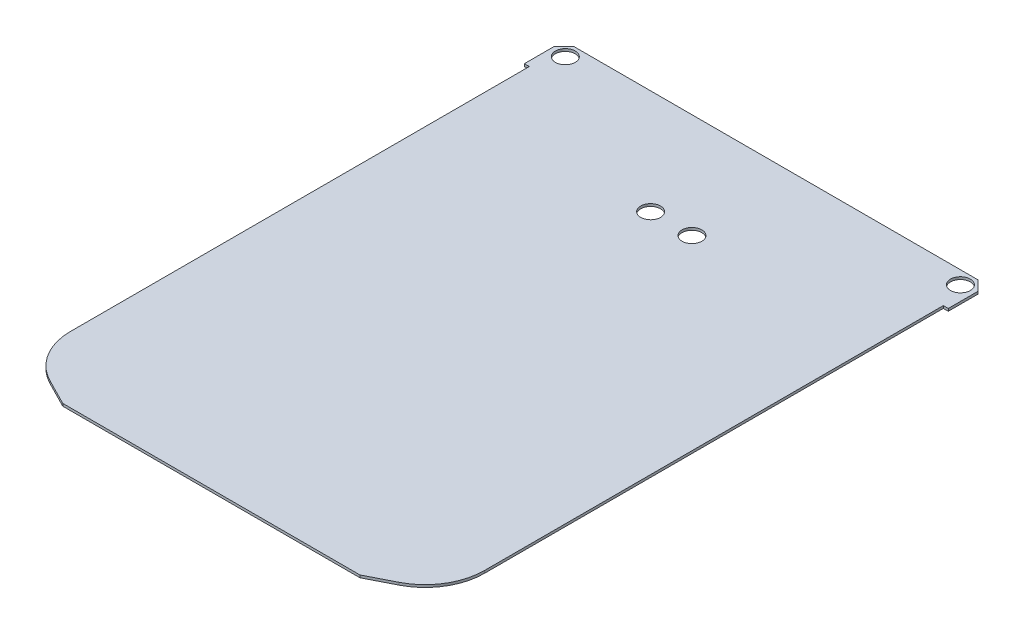
ISO-10303-21;
HEADER;
FILE_DESCRIPTION(('STEP AP214'),'2;1');
FILE_NAME('part.step','',(''),(''),'','','');
FILE_SCHEMA(('AUTOMOTIVE_DESIGN { 1 0 10303 214 1 1 1 1 }'));
ENDSEC;
DATA;
#1=APPLICATION_CONTEXT('core data for automotive mechanical design processes');
#2=APPLICATION_PROTOCOL_DEFINITION('international standard','automotive_design',2000,#1);
#3=PRODUCT_CONTEXT('',#1,'mechanical');
#4=PRODUCT('Part','Part','',(#3));
#5=PRODUCT_RELATED_PRODUCT_CATEGORY('part','',(#4));
#6=PRODUCT_DEFINITION_FORMATION('','',#4);
#7=PRODUCT_DEFINITION_CONTEXT('part definition',#1,'design');
#8=PRODUCT_DEFINITION('design','',#6,#7);
#9=PRODUCT_DEFINITION_SHAPE('','',#8);
#10=(LENGTH_UNIT() NAMED_UNIT(*) SI_UNIT(.MILLI.,.METRE.));
#11=(NAMED_UNIT(*) PLANE_ANGLE_UNIT() SI_UNIT($,.RADIAN.));
#12=(NAMED_UNIT(*) SI_UNIT($,.STERADIAN.) SOLID_ANGLE_UNIT());
#13=UNCERTAINTY_MEASURE_WITH_UNIT(LENGTH_MEASURE(1.E-05),#10,'distance_accuracy_value','');
#14=(GEOMETRIC_REPRESENTATION_CONTEXT(3) GLOBAL_UNCERTAINTY_ASSIGNED_CONTEXT((#13)) GLOBAL_UNIT_ASSIGNED_CONTEXT((#10,
#11,#12)) REPRESENTATION_CONTEXT('',''));
#15=CARTESIAN_POINT('',(0.,0.,0.));
#16=DIRECTION('',(0.,0.,1.));
#17=DIRECTION('',(1.,0.,0.));
#18=AXIS2_PLACEMENT_3D('',#15,#16,#17);
#19=CARTESIAN_POINT('',(0.,0.25,0.));
#20=DIRECTION('',(0.,1.,0.));
#21=DIRECTION('',(0.,0.,1.));
#22=AXIS2_PLACEMENT_3D('',#19,#20,#21);
#23=PLANE('',#22);
#24=CARTESIAN_POINT('',(-2.08453018887491,0.25,-19.9344650756313));
#25=DIRECTION('',(0.,1.,0.));
#26=DIRECTION('',(0.,0.,1.));
#27=AXIS2_PLACEMENT_3D('',#24,#25,#26);
#28=CIRCLE('',#27,1.);
#29=CARTESIAN_POINT('',(-2.08453018887491,0.25,-18.9344650756313));
#30=VERTEX_POINT('',#29);
#31=EDGE_CURVE('E170',#30,#30,#28,.T.);
#32=ORIENTED_EDGE('',*,*,#31,.F.);
#33=EDGE_LOOP('',(#32));
#34=FACE_BOUND('',#33,.T.);
#35=CARTESIAN_POINT('',(2.08453018887492,0.25,-19.9344650756313));
#36=DIRECTION('',(0.,1.,0.));
#37=DIRECTION('',(0.,0.,1.));
#38=AXIS2_PLACEMENT_3D('',#35,#36,#37);
#39=CIRCLE('',#38,1.);
#40=CARTESIAN_POINT('',(2.08453018887492,0.25,-18.9344650756312));
#41=VERTEX_POINT('',#40);
#42=EDGE_CURVE('E275',#41,#41,#39,.T.);
#43=ORIENTED_EDGE('',*,*,#42,.F.);
#44=EDGE_LOOP('',(#43));
#45=FACE_BOUND('',#44,.T.);
#46=CARTESIAN_POINT('',(19.9443650813896,0.25,-29.1813924256585));
#47=DIRECTION('',(0.,1.,0.));
#48=DIRECTION('',(0.,0.,-1.));
#49=AXIS2_PLACEMENT_3D('',#46,#47,#48);
#50=CIRCLE('',#49,1.00000000000001);
#51=CARTESIAN_POINT('',(19.9443650813896,0.25,-30.1813924256585));
#52=VERTEX_POINT('',#51);
#53=EDGE_CURVE('E262',#52,#52,#50,.T.);
#54=ORIENTED_EDGE('',*,*,#53,.F.);
#55=EDGE_LOOP('',(#54));
#56=FACE_BOUND('',#55,.T.);
#57=DIRECTION('',(0.891385130206805,0.,-0.453246676376339));
#58=VECTOR('',#57,1.);
#59=CARTESIAN_POINT('',(15.,0.25,26.5));
#60=LINE('',#59,#58);
#61=CARTESIAN_POINT('',(15.,0.25,26.5));
#62=VERTEX_POINT('',#61);
#63=CARTESIAN_POINT('',(17.619480058258,0.25,25.1680609873264));
#64=VERTEX_POINT('',#63);
#65=EDGE_CURVE('E245',#62,#64,#60,.T.);
#66=ORIENTED_EDGE('',*,*,#65,.T.);
#67=CARTESIAN_POINT('',(14.9,0.25,19.8197502060856));
#68=DIRECTION('',(0.,1.,0.));
#69=DIRECTION('',(0.,0.,1.));
#70=AXIS2_PLACEMENT_3D('',#67,#68,#69);
#71=CIRCLE('',#70,6.);
#72=CARTESIAN_POINT('',(20.9,0.25,19.8197502060856));
#73=VERTEX_POINT('',#72);
#74=EDGE_CURVE('E180',#64,#73,#71,.T.);
#75=ORIENTED_EDGE('',*,*,#74,.T.);
#76=DIRECTION('',(0.,0.,-1.));
#77=VECTOR('',#76,1.);
#78=CARTESIAN_POINT('',(20.9,0.25,23.5));
#79=LINE('',#78,#77);
#80=CARTESIAN_POINT('',(20.9,0.25,-26.5));
#81=VERTEX_POINT('',#80);
#82=EDGE_CURVE('E247',#73,#81,#79,.T.);
#83=ORIENTED_EDGE('',*,*,#82,.T.);
#84=DIRECTION('',(1.,0.,0.));
#85=VECTOR('',#84,1.);
#86=CARTESIAN_POINT('',(21.4,0.25,-26.5));
#87=LINE('',#86,#85);
#88=CARTESIAN_POINT('',(21.4,0.25,-26.5));
#89=VERTEX_POINT('',#88);
#90=EDGE_CURVE('E253',#81,#89,#87,.T.);
#91=ORIENTED_EDGE('',*,*,#90,.T.);
#92=DIRECTION('',(0.,0.,-1.));
#93=VECTOR('',#92,1.);
#94=CARTESIAN_POINT('',(21.4,0.25,-29.5));
#95=LINE('',#94,#93);
#96=CARTESIAN_POINT('',(21.4,0.25,-29.5));
#97=VERTEX_POINT('',#96);
#98=EDGE_CURVE('E255',#89,#97,#95,.T.);
#99=ORIENTED_EDGE('',*,*,#98,.T.);
#100=DIRECTION('',(-0.707106781186546,0.,-0.707106781186549));
#101=VECTOR('',#100,1.);
#102=CARTESIAN_POINT('',(21.4,0.25,-29.5));
#103=LINE('',#102,#101);
#104=CARTESIAN_POINT('',(20.4,0.25,-30.5));
#105=VERTEX_POINT('',#104);
#106=EDGE_CURVE('E257',#97,#105,#103,.T.);
#107=ORIENTED_EDGE('',*,*,#106,.T.);
#108=DIRECTION('',(-1.,0.,0.));
#109=VECTOR('',#108,1.);
#110=CARTESIAN_POINT('',(-20.4,0.25,-30.5));
#111=LINE('',#110,#109);
#112=CARTESIAN_POINT('',(-20.4,0.25,-30.5));
#113=VERTEX_POINT('',#112);
#114=EDGE_CURVE('E259',#105,#113,#111,.T.);
#115=ORIENTED_EDGE('',*,*,#114,.T.);
#116=DIRECTION('',(-0.707106781186544,0.,0.707106781186551));
#117=VECTOR('',#116,1.);
#118=CARTESIAN_POINT('',(-21.4,0.25,-29.5));
#119=LINE('',#118,#117);
#120=CARTESIAN_POINT('',(-21.4,0.25,-29.5));
#121=VERTEX_POINT('',#120);
#122=EDGE_CURVE('E148',#113,#121,#119,.T.);
#123=ORIENTED_EDGE('',*,*,#122,.T.);
#124=DIRECTION('',(0.,0.,1.));
#125=VECTOR('',#124,1.);
#126=CARTESIAN_POINT('',(-21.4,0.25,-29.5));
#127=LINE('',#126,#125);
#128=CARTESIAN_POINT('',(-21.4,0.25,-26.5));
#129=VERTEX_POINT('',#128);
#130=EDGE_CURVE('E142',#121,#129,#127,.T.);
#131=ORIENTED_EDGE('',*,*,#130,.T.);
#132=DIRECTION('',(1.,0.,0.));
#133=VECTOR('',#132,1.);
#134=CARTESIAN_POINT('',(-21.4,0.25,-26.5));
#135=LINE('',#134,#133);
#136=CARTESIAN_POINT('',(-20.9,0.25,-26.5));
#137=VERTEX_POINT('',#136);
#138=EDGE_CURVE('E133',#129,#137,#135,.T.);
#139=ORIENTED_EDGE('',*,*,#138,.T.);
#140=DIRECTION('',(0.,0.,1.));
#141=VECTOR('',#140,1.);
#142=CARTESIAN_POINT('',(-20.9,0.25,-26.5));
#143=LINE('',#142,#141);
#144=CARTESIAN_POINT('',(-20.9,0.25,19.8197502060856));
#145=VERTEX_POINT('',#144);
#146=EDGE_CURVE('E141',#137,#145,#143,.T.);
#147=ORIENTED_EDGE('',*,*,#146,.T.);
#148=CARTESIAN_POINT('',(-14.9,0.25,19.8197502060856));
#149=DIRECTION('',(0.,1.,0.));
#150=DIRECTION('',(0.,0.,1.));
#151=AXIS2_PLACEMENT_3D('',#148,#149,#150);
#152=CIRCLE('',#151,6.);
#153=CARTESIAN_POINT('',(-17.619480058258,0.25,25.1680609873264));
#154=VERTEX_POINT('',#153);
#155=EDGE_CURVE('E47',#145,#154,#152,.T.);
#156=ORIENTED_EDGE('',*,*,#155,.T.);
#157=DIRECTION('',(0.891385130206805,0.,0.453246676376339));
#158=VECTOR('',#157,1.);
#159=CARTESIAN_POINT('',(-20.9,0.25,23.5));
#160=LINE('',#159,#158);
#161=CARTESIAN_POINT('',(-15.,0.25,26.5));
#162=VERTEX_POINT('',#161);
#163=EDGE_CURVE('E189',#154,#162,#160,.T.);
#164=ORIENTED_EDGE('',*,*,#163,.T.);
#165=DIRECTION('',(1.,0.,0.));
#166=VECTOR('',#165,1.);
#167=CARTESIAN_POINT('',(-15.,0.25,26.5));
#168=LINE('',#167,#166);
#169=EDGE_CURVE('E243',#162,#62,#168,.T.);
#170=ORIENTED_EDGE('',*,*,#169,.T.);
#171=EDGE_LOOP('',(#66,#75,#83,#91,#99,#107,#115,#123,#131,#139,#147,#156,#164,#170));
#172=FACE_BOUND('',#171,.T.);
#173=CARTESIAN_POINT('',(-19.9443650813896,0.25,-29.1813924256585));
#174=DIRECTION('',(0.,1.,0.));
#175=DIRECTION('',(0.,0.,1.));
#176=AXIS2_PLACEMENT_3D('',#173,#174,#175);
#177=CIRCLE('',#176,0.999999999999998);
#178=CARTESIAN_POINT('',(-19.9443650813896,0.25,-28.1813924256585));
#179=VERTEX_POINT('',#178);
#180=EDGE_CURVE('E268',#179,#179,#177,.T.);
#181=ORIENTED_EDGE('',*,*,#180,.F.);
#182=EDGE_LOOP('',(#181));
#183=FACE_BOUND('',#182,.T.);
#184=ADVANCED_FACE('F32',(#34,#45,#56,#172,#183),#23,.T.);
#185=CARTESIAN_POINT('',(0.,0.,0.));
#186=DIRECTION('',(0.,1.,0.));
#187=DIRECTION('',(0.,0.,1.));
#188=AXIS2_PLACEMENT_3D('',#185,#186,#187);
#189=PLANE('',#188);
#190=CARTESIAN_POINT('',(-2.08453018887491,0.,-19.9344650756313));
#191=DIRECTION('',(0.,1.,0.));
#192=DIRECTION('',(0.,0.,1.));
#193=AXIS2_PLACEMENT_3D('',#190,#191,#192);
#194=CIRCLE('',#193,1.);
#195=CARTESIAN_POINT('',(-2.08453018887491,0.,-18.9344650756313));
#196=VERTEX_POINT('',#195);
#197=EDGE_CURVE('E169',#196,#196,#194,.T.);
#198=ORIENTED_EDGE('',*,*,#197,.T.);
#199=EDGE_LOOP('',(#198));
#200=FACE_BOUND('',#199,.T.);
#201=CARTESIAN_POINT('',(2.08453018887492,0.,-19.9344650756313));
#202=DIRECTION('',(0.,1.,0.));
#203=DIRECTION('',(0.,0.,1.));
#204=AXIS2_PLACEMENT_3D('',#201,#202,#203);
#205=CIRCLE('',#204,1.);
#206=CARTESIAN_POINT('',(2.08453018887492,0.,-18.9344650756312));
#207=VERTEX_POINT('',#206);
#208=EDGE_CURVE('E166',#207,#207,#205,.T.);
#209=ORIENTED_EDGE('',*,*,#208,.T.);
#210=EDGE_LOOP('',(#209));
#211=FACE_BOUND('',#210,.T.);
#212=DIRECTION('',(0.,0.,-1.));
#213=VECTOR('',#212,1.);
#214=CARTESIAN_POINT('',(20.9,0.,23.5));
#215=LINE('',#214,#213);
#216=CARTESIAN_POINT('',(20.9,0.,19.8197502060856));
#217=VERTEX_POINT('',#216);
#218=CARTESIAN_POINT('',(20.9,0.,-26.5));
#219=VERTEX_POINT('',#218);
#220=EDGE_CURVE('E209',#217,#219,#215,.T.);
#221=ORIENTED_EDGE('',*,*,#220,.F.);
#222=CARTESIAN_POINT('',(14.9,0.,19.8197502060856));
#223=DIRECTION('',(0.,1.,0.));
#224=DIRECTION('',(0.,0.,1.));
#225=AXIS2_PLACEMENT_3D('',#222,#223,#224);
#226=CIRCLE('',#225,6.);
#227=CARTESIAN_POINT('',(17.619480058258,0.,25.1680609873264));
#228=VERTEX_POINT('',#227);
#229=EDGE_CURVE('E175',#217,#228,#226,.F.);
#230=ORIENTED_EDGE('',*,*,#229,.T.);
#231=DIRECTION('',(0.891385130206805,0.,-0.453246676376339));
#232=VECTOR('',#231,1.);
#233=CARTESIAN_POINT('',(15.,0.,26.5));
#234=LINE('',#233,#232);
#235=CARTESIAN_POINT('',(15.,0.,26.5));
#236=VERTEX_POINT('',#235);
#237=EDGE_CURVE('E201',#236,#228,#234,.T.);
#238=ORIENTED_EDGE('',*,*,#237,.F.);
#239=DIRECTION('',(1.,0.,0.));
#240=VECTOR('',#239,1.);
#241=CARTESIAN_POINT('',(-15.,0.,26.5));
#242=LINE('',#241,#240);
#243=CARTESIAN_POINT('',(-15.,0.,26.5));
#244=VERTEX_POINT('',#243);
#245=EDGE_CURVE('E198',#244,#236,#242,.T.);
#246=ORIENTED_EDGE('',*,*,#245,.F.);
#247=DIRECTION('',(0.891385130206805,0.,0.453246676376339));
#248=VECTOR('',#247,1.);
#249=CARTESIAN_POINT('',(-20.9,0.,23.5));
#250=LINE('',#249,#248);
#251=CARTESIAN_POINT('',(-17.619480058258,0.,25.1680609873264));
#252=VERTEX_POINT('',#251);
#253=EDGE_CURVE('E187',#252,#244,#250,.T.);
#254=ORIENTED_EDGE('',*,*,#253,.F.);
#255=CARTESIAN_POINT('',(-14.9,0.,19.8197502060856));
#256=DIRECTION('',(0.,1.,0.));
#257=DIRECTION('',(0.,0.,1.));
#258=AXIS2_PLACEMENT_3D('',#255,#256,#257);
#259=CIRCLE('',#258,6.);
#260=CARTESIAN_POINT('',(-20.9,0.,19.8197502060856));
#261=VERTEX_POINT('',#260);
#262=EDGE_CURVE('E160',#252,#261,#259,.F.);
#263=ORIENTED_EDGE('',*,*,#262,.T.);
#264=DIRECTION('',(0.,0.,1.));
#265=VECTOR('',#264,1.);
#266=CARTESIAN_POINT('',(-20.9,0.,-26.5));
#267=LINE('',#266,#265);
#268=CARTESIAN_POINT('',(-20.9,0.,-26.5));
#269=VERTEX_POINT('',#268);
#270=EDGE_CURVE('E199',#269,#261,#267,.T.);
#271=ORIENTED_EDGE('',*,*,#270,.F.);
#272=DIRECTION('',(1.,0.,0.));
#273=VECTOR('',#272,1.);
#274=CARTESIAN_POINT('',(-21.4,0.,-26.5));
#275=LINE('',#274,#273);
#276=CARTESIAN_POINT('',(-21.4,0.,-26.5));
#277=VERTEX_POINT('',#276);
#278=EDGE_CURVE('E203',#277,#269,#275,.T.);
#279=ORIENTED_EDGE('',*,*,#278,.F.);
#280=DIRECTION('',(0.,0.,1.));
#281=VECTOR('',#280,1.);
#282=CARTESIAN_POINT('',(-21.4,0.,-29.5));
#283=LINE('',#282,#281);
#284=CARTESIAN_POINT('',(-21.4,0.,-29.5));
#285=VERTEX_POINT('',#284);
#286=EDGE_CURVE('E156',#285,#277,#283,.T.);
#287=ORIENTED_EDGE('',*,*,#286,.F.);
#288=DIRECTION('',(-0.707106781186544,0.,0.707106781186551));
#289=VECTOR('',#288,1.);
#290=CARTESIAN_POINT('',(-21.4,0.,-29.5));
#291=LINE('',#290,#289);
#292=CARTESIAN_POINT('',(-20.4,0.,-30.5));
#293=VERTEX_POINT('',#292);
#294=EDGE_CURVE('E152',#293,#285,#291,.T.);
#295=ORIENTED_EDGE('',*,*,#294,.F.);
#296=DIRECTION('',(-1.,0.,0.));
#297=VECTOR('',#296,1.);
#298=CARTESIAN_POINT('',(-20.4,0.,-30.5));
#299=LINE('',#298,#297);
#300=CARTESIAN_POINT('',(20.4,0.,-30.5));
#301=VERTEX_POINT('',#300);
#302=EDGE_CURVE('E217',#301,#293,#299,.T.);
#303=ORIENTED_EDGE('',*,*,#302,.F.);
#304=DIRECTION('',(-0.707106781186546,0.,-0.707106781186549));
#305=VECTOR('',#304,1.);
#306=CARTESIAN_POINT('',(21.4,0.,-29.5));
#307=LINE('',#306,#305);
#308=CARTESIAN_POINT('',(21.4,0.,-29.5));
#309=VERTEX_POINT('',#308);
#310=EDGE_CURVE('E215',#309,#301,#307,.T.);
#311=ORIENTED_EDGE('',*,*,#310,.F.);
#312=DIRECTION('',(0.,0.,-1.));
#313=VECTOR('',#312,1.);
#314=CARTESIAN_POINT('',(21.4,0.,-29.5));
#315=LINE('',#314,#313);
#316=CARTESIAN_POINT('',(21.4,0.,-26.5));
#317=VERTEX_POINT('',#316);
#318=EDGE_CURVE('E213',#317,#309,#315,.T.);
#319=ORIENTED_EDGE('',*,*,#318,.F.);
#320=DIRECTION('',(1.,0.,0.));
#321=VECTOR('',#320,1.);
#322=CARTESIAN_POINT('',(21.4,0.,-26.5));
#323=LINE('',#322,#321);
#324=EDGE_CURVE('E211',#219,#317,#323,.T.);
#325=ORIENTED_EDGE('',*,*,#324,.F.);
#326=EDGE_LOOP('',(#221,#230,#238,#246,#254,#263,#271,#279,#287,#295,#303,#311,#319,#325));
#327=FACE_BOUND('',#326,.T.);
#328=CARTESIAN_POINT('',(19.9443650813896,0.,-29.1813924256585));
#329=DIRECTION('',(0.,1.,0.));
#330=DIRECTION('',(0.,0.,-1.));
#331=AXIS2_PLACEMENT_3D('',#328,#329,#330);
#332=CIRCLE('',#331,1.00000000000001);
#333=CARTESIAN_POINT('',(19.9443650813896,0.,-30.1813924256585));
#334=VERTEX_POINT('',#333);
#335=EDGE_CURVE('E265',#334,#334,#332,.T.);
#336=ORIENTED_EDGE('',*,*,#335,.T.);
#337=EDGE_LOOP('',(#336));
#338=FACE_BOUND('',#337,.T.);
#339=CARTESIAN_POINT('',(-19.9443650813896,0.,-29.1813924256585));
#340=DIRECTION('',(0.,1.,0.));
#341=DIRECTION('',(0.,0.,1.));
#342=AXIS2_PLACEMENT_3D('',#339,#340,#341);
#343=CIRCLE('',#342,0.999999999999998);
#344=CARTESIAN_POINT('',(-19.9443650813896,0.,-28.1813924256585));
#345=VERTEX_POINT('',#344);
#346=EDGE_CURVE('E172',#345,#345,#343,.T.);
#347=ORIENTED_EDGE('',*,*,#346,.T.);
#348=EDGE_LOOP('',(#347));
#349=FACE_BOUND('',#348,.T.);
#350=ADVANCED_FACE('F194',(#200,#211,#327,#338,#349),#189,.F.);
#351=CARTESIAN_POINT('',(-21.4,0.25,-29.5));
#352=DIRECTION('',(1.,0.,0.));
#353=DIRECTION('',(0.,0.,-1.));
#354=AXIS2_PLACEMENT_3D('',#351,#352,#353);
#355=PLANE('',#354);
#356=ORIENTED_EDGE('',*,*,#286,.T.);
#357=DIRECTION('',(0.,-1.,0.));
#358=VECTOR('',#357,1.);
#359=CARTESIAN_POINT('',(-21.4,0.25,-26.5));
#360=LINE('',#359,#358);
#361=EDGE_CURVE('E137',#129,#277,#360,.T.);
#362=ORIENTED_EDGE('',*,*,#361,.F.);
#363=ORIENTED_EDGE('',*,*,#130,.F.);
#364=DIRECTION('',(0.,-1.,0.));
#365=VECTOR('',#364,1.);
#366=CARTESIAN_POINT('',(-21.4,0.25,-29.5));
#367=LINE('',#366,#365);
#368=EDGE_CURVE('E220',#121,#285,#367,.T.);
#369=ORIENTED_EDGE('',*,*,#368,.T.);
#370=EDGE_LOOP('',(#356,#362,#363,#369));
#371=FACE_BOUND('',#370,.T.);
#372=ADVANCED_FACE('F154',(#371),#355,.F.);
#373=CARTESIAN_POINT('',(-21.4,0.25,-26.5));
#374=DIRECTION('',(0.,0.,-1.));
#375=DIRECTION('',(-1.,0.,0.));
#376=AXIS2_PLACEMENT_3D('',#373,#374,#375);
#377=PLANE('',#376);
#378=ORIENTED_EDGE('',*,*,#278,.T.);
#379=DIRECTION('',(0.,-1.,0.));
#380=VECTOR('',#379,1.);
#381=CARTESIAN_POINT('',(-20.9,0.25,-26.5));
#382=LINE('',#381,#380);
#383=EDGE_CURVE('E140',#137,#269,#382,.T.);
#384=ORIENTED_EDGE('',*,*,#383,.F.);
#385=ORIENTED_EDGE('',*,*,#138,.F.);
#386=ORIENTED_EDGE('',*,*,#361,.T.);
#387=EDGE_LOOP('',(#378,#384,#385,#386));
#388=FACE_BOUND('',#387,.T.);
#389=ADVANCED_FACE('F135',(#388),#377,.F.);
#390=CARTESIAN_POINT('',(-20.9,0.25,-26.5));
#391=DIRECTION('',(1.,0.,0.));
#392=DIRECTION('',(0.,0.,-1.));
#393=AXIS2_PLACEMENT_3D('',#390,#391,#392);
#394=PLANE('',#393);
#395=ORIENTED_EDGE('',*,*,#270,.T.);
#396=DIRECTION('',(0.,-1.,0.));
#397=VECTOR('',#396,1.);
#398=CARTESIAN_POINT('',(-20.9,0.25,19.8197502060856));
#399=LINE('',#398,#397);
#400=EDGE_CURVE('E11',#261,#145,#399,.F.);
#401=ORIENTED_EDGE('',*,*,#400,.T.);
#402=ORIENTED_EDGE('',*,*,#146,.F.);
#403=ORIENTED_EDGE('',*,*,#383,.T.);
#404=EDGE_LOOP('',(#395,#401,#402,#403));
#405=FACE_BOUND('',#404,.T.);
#406=ADVANCED_FACE('F263',(#405),#394,.F.);
#407=CARTESIAN_POINT('',(-20.9,0.25,23.5));
#408=DIRECTION('',(0.453246676376339,0.,-0.891385130206805));
#409=DIRECTION('',(-0.891385130206805,0.,-0.453246676376339));
#410=AXIS2_PLACEMENT_3D('',#407,#408,#409);
#411=PLANE('',#410);
#412=ORIENTED_EDGE('',*,*,#163,.F.);
#413=DIRECTION('',(0.,-1.,0.));
#414=VECTOR('',#413,1.);
#415=CARTESIAN_POINT('',(-17.619480058258,0.25,25.1680609873264));
#416=LINE('',#415,#414);
#417=EDGE_CURVE('E40',#154,#252,#416,.T.);
#418=ORIENTED_EDGE('',*,*,#417,.T.);
#419=ORIENTED_EDGE('',*,*,#253,.T.);
#420=DIRECTION('',(0.,-1.,0.));
#421=VECTOR('',#420,1.);
#422=CARTESIAN_POINT('',(-15.,0.25,26.5));
#423=LINE('',#422,#421);
#424=EDGE_CURVE('E162',#162,#244,#423,.T.);
#425=ORIENTED_EDGE('',*,*,#424,.F.);
#426=EDGE_LOOP('',(#412,#418,#419,#425));
#427=FACE_BOUND('',#426,.T.);
#428=ADVANCED_FACE('F185',(#427),#411,.F.);
#429=CARTESIAN_POINT('',(-15.,0.25,26.5));
#430=DIRECTION('',(0.,0.,-1.));
#431=DIRECTION('',(-1.,0.,0.));
#432=AXIS2_PLACEMENT_3D('',#429,#430,#431);
#433=PLANE('',#432);
#434=ORIENTED_EDGE('',*,*,#245,.T.);
#435=DIRECTION('',(0.,-1.,0.));
#436=VECTOR('',#435,1.);
#437=CARTESIAN_POINT('',(15.,0.25,26.5));
#438=LINE('',#437,#436);
#439=EDGE_CURVE('E237',#62,#236,#438,.T.);
#440=ORIENTED_EDGE('',*,*,#439,.F.);
#441=ORIENTED_EDGE('',*,*,#169,.F.);
#442=ORIENTED_EDGE('',*,*,#424,.T.);
#443=EDGE_LOOP('',(#434,#440,#441,#442));
#444=FACE_BOUND('',#443,.T.);
#445=ADVANCED_FACE('F241',(#444),#433,.F.);
#446=CARTESIAN_POINT('',(15.,0.25,26.5));
#447=DIRECTION('',(-0.453246676376339,0.,-0.891385130206805));
#448=DIRECTION('',(-0.891385130206805,0.,0.453246676376339));
#449=AXIS2_PLACEMENT_3D('',#446,#447,#448);
#450=PLANE('',#449);
#451=ORIENTED_EDGE('',*,*,#237,.T.);
#452=DIRECTION('',(0.,-1.,0.));
#453=VECTOR('',#452,1.);
#454=CARTESIAN_POINT('',(17.619480058258,0.25,25.1680609873264));
#455=LINE('',#454,#453);
#456=EDGE_CURVE('E177',#228,#64,#455,.F.);
#457=ORIENTED_EDGE('',*,*,#456,.T.);
#458=ORIENTED_EDGE('',*,*,#65,.F.);
#459=ORIENTED_EDGE('',*,*,#439,.T.);
#460=EDGE_LOOP('',(#451,#457,#458,#459));
#461=FACE_BOUND('',#460,.T.);
#462=ADVANCED_FACE('F337',(#461),#450,.F.);
#463=CARTESIAN_POINT('',(20.9,0.25,23.5));
#464=DIRECTION('',(-1.,0.,0.));
#465=DIRECTION('',(0.,0.,1.));
#466=AXIS2_PLACEMENT_3D('',#463,#464,#465);
#467=PLANE('',#466);
#468=ORIENTED_EDGE('',*,*,#82,.F.);
#469=DIRECTION('',(0.,-1.,0.));
#470=VECTOR('',#469,1.);
#471=CARTESIAN_POINT('',(20.9,0.25,19.8197502060856));
#472=LINE('',#471,#470);
#473=EDGE_CURVE('E157',#73,#217,#472,.T.);
#474=ORIENTED_EDGE('',*,*,#473,.T.);
#475=ORIENTED_EDGE('',*,*,#220,.T.);
#476=DIRECTION('',(0.,-1.,0.));
#477=VECTOR('',#476,1.);
#478=CARTESIAN_POINT('',(20.9,0.25,-26.5));
#479=LINE('',#478,#477);
#480=EDGE_CURVE('E234',#81,#219,#479,.T.);
#481=ORIENTED_EDGE('',*,*,#480,.F.);
#482=EDGE_LOOP('',(#468,#474,#475,#481));
#483=FACE_BOUND('',#482,.T.);
#484=ADVANCED_FACE('F333',(#483),#467,.F.);
#485=CARTESIAN_POINT('',(21.4,0.25,-26.5));
#486=DIRECTION('',(0.,0.,-1.));
#487=DIRECTION('',(-1.,0.,0.));
#488=AXIS2_PLACEMENT_3D('',#485,#486,#487);
#489=PLANE('',#488);
#490=ORIENTED_EDGE('',*,*,#324,.T.);
#491=DIRECTION('',(0.,-1.,0.));
#492=VECTOR('',#491,1.);
#493=CARTESIAN_POINT('',(21.4,0.25,-26.5));
#494=LINE('',#493,#492);
#495=EDGE_CURVE('E231',#89,#317,#494,.T.);
#496=ORIENTED_EDGE('',*,*,#495,.F.);
#497=ORIENTED_EDGE('',*,*,#90,.F.);
#498=ORIENTED_EDGE('',*,*,#480,.T.);
#499=EDGE_LOOP('',(#490,#496,#497,#498));
#500=FACE_BOUND('',#499,.T.);
#501=ADVANCED_FACE('F329',(#500),#489,.F.);
#502=CARTESIAN_POINT('',(21.4,0.25,-29.5));
#503=DIRECTION('',(-1.,0.,0.));
#504=DIRECTION('',(0.,0.,1.));
#505=AXIS2_PLACEMENT_3D('',#502,#503,#504);
#506=PLANE('',#505);
#507=ORIENTED_EDGE('',*,*,#318,.T.);
#508=DIRECTION('',(0.,-1.,0.));
#509=VECTOR('',#508,1.);
#510=CARTESIAN_POINT('',(21.4,0.25,-29.5));
#511=LINE('',#510,#509);
#512=EDGE_CURVE('E228',#97,#309,#511,.T.);
#513=ORIENTED_EDGE('',*,*,#512,.F.);
#514=ORIENTED_EDGE('',*,*,#98,.F.);
#515=ORIENTED_EDGE('',*,*,#495,.T.);
#516=EDGE_LOOP('',(#507,#513,#514,#515));
#517=FACE_BOUND('',#516,.T.);
#518=ADVANCED_FACE('F325',(#517),#506,.F.);
#519=CARTESIAN_POINT('',(21.4,0.25,-29.5));
#520=DIRECTION('',(-0.707106781186549,0.,0.707106781186546));
#521=DIRECTION('',(0.707106781186546,0.,0.707106781186549));
#522=AXIS2_PLACEMENT_3D('',#519,#520,#521);
#523=PLANE('',#522);
#524=ORIENTED_EDGE('',*,*,#310,.T.);
#525=DIRECTION('',(0.,-1.,0.));
#526=VECTOR('',#525,1.);
#527=CARTESIAN_POINT('',(20.4,0.25,-30.5));
#528=LINE('',#527,#526);
#529=EDGE_CURVE('E225',#105,#301,#528,.T.);
#530=ORIENTED_EDGE('',*,*,#529,.F.);
#531=ORIENTED_EDGE('',*,*,#106,.F.);
#532=ORIENTED_EDGE('',*,*,#512,.T.);
#533=EDGE_LOOP('',(#524,#530,#531,#532));
#534=FACE_BOUND('',#533,.T.);
#535=ADVANCED_FACE('F321',(#534),#523,.F.);
#536=CARTESIAN_POINT('',(-20.4,0.25,-30.5));
#537=DIRECTION('',(0.,0.,1.));
#538=DIRECTION('',(1.,0.,0.));
#539=AXIS2_PLACEMENT_3D('',#536,#537,#538);
#540=PLANE('',#539);
#541=ORIENTED_EDGE('',*,*,#302,.T.);
#542=DIRECTION('',(0.,-1.,0.));
#543=VECTOR('',#542,1.);
#544=CARTESIAN_POINT('',(-20.4,0.25,-30.5));
#545=LINE('',#544,#543);
#546=EDGE_CURVE('E222',#113,#293,#545,.T.);
#547=ORIENTED_EDGE('',*,*,#546,.F.);
#548=ORIENTED_EDGE('',*,*,#114,.F.);
#549=ORIENTED_EDGE('',*,*,#529,.T.);
#550=EDGE_LOOP('',(#541,#547,#548,#549));
#551=FACE_BOUND('',#550,.T.);
#552=ADVANCED_FACE('F317',(#551),#540,.F.);
#553=CARTESIAN_POINT('',(-21.4,0.25,-29.5));
#554=DIRECTION('',(0.707106781186551,0.,0.707106781186544));
#555=DIRECTION('',(0.707106781186544,0.,-0.707106781186551));
#556=AXIS2_PLACEMENT_3D('',#553,#554,#555);
#557=PLANE('',#556);
#558=ORIENTED_EDGE('',*,*,#294,.T.);
#559=ORIENTED_EDGE('',*,*,#368,.F.);
#560=ORIENTED_EDGE('',*,*,#122,.F.);
#561=ORIENTED_EDGE('',*,*,#546,.T.);
#562=EDGE_LOOP('',(#558,#559,#560,#561));
#563=FACE_BOUND('',#562,.T.);
#564=ADVANCED_FACE('F295',(#563),#557,.F.);
#565=CARTESIAN_POINT('',(19.9443650813896,0.25,-29.1813924256585));
#566=DIRECTION('',(0.,-1.,0.));
#567=DIRECTION('',(0.,0.,-1.));
#568=AXIS2_PLACEMENT_3D('',#565,#566,#567);
#569=CYLINDRICAL_SURFACE('',#568,1.00000000000001);
#570=ORIENTED_EDGE('',*,*,#53,.T.);
#571=EDGE_LOOP('',(#570));
#572=FACE_BOUND('',#571,.T.);
#573=ORIENTED_EDGE('',*,*,#335,.F.);
#574=EDGE_LOOP('',(#573));
#575=FACE_BOUND('',#574,.T.);
#576=ADVANCED_FACE('F291',(#572,#575),#569,.F.);
#577=CARTESIAN_POINT('',(-19.9443650813896,0.25,-29.1813924256585));
#578=DIRECTION('',(0.,-1.,0.));
#579=DIRECTION('',(0.,0.,-1.));
#580=AXIS2_PLACEMENT_3D('',#577,#578,#579);
#581=CYLINDRICAL_SURFACE('',#580,0.999999999999998);
#582=ORIENTED_EDGE('',*,*,#180,.T.);
#583=EDGE_LOOP('',(#582));
#584=FACE_BOUND('',#583,.T.);
#585=ORIENTED_EDGE('',*,*,#346,.F.);
#586=EDGE_LOOP('',(#585));
#587=FACE_BOUND('',#586,.T.);
#588=ADVANCED_FACE('F294',(#584,#587),#581,.F.);
#589=CARTESIAN_POINT('',(2.08453018887492,-4.25,-19.9344650756313));
#590=DIRECTION('',(0.,1.,0.));
#591=DIRECTION('',(0.,0.,1.));
#592=AXIS2_PLACEMENT_3D('',#589,#590,#591);
#593=CYLINDRICAL_SURFACE('',#592,1.);
#594=ORIENTED_EDGE('',*,*,#42,.T.);
#595=EDGE_LOOP('',(#594));
#596=FACE_BOUND('',#595,.T.);
#597=ORIENTED_EDGE('',*,*,#208,.F.);
#598=EDGE_LOOP('',(#597));
#599=FACE_BOUND('',#598,.T.);
#600=ADVANCED_FACE('F305',(#596,#599),#593,.F.);
#601=CARTESIAN_POINT('',(-2.08453018887491,-4.25,-19.9344650756313));
#602=DIRECTION('',(0.,1.,0.));
#603=DIRECTION('',(0.,0.,1.));
#604=AXIS2_PLACEMENT_3D('',#601,#602,#603);
#605=CYLINDRICAL_SURFACE('',#604,1.);
#606=ORIENTED_EDGE('',*,*,#31,.T.);
#607=EDGE_LOOP('',(#606));
#608=FACE_BOUND('',#607,.T.);
#609=ORIENTED_EDGE('',*,*,#197,.F.);
#610=EDGE_LOOP('',(#609));
#611=FACE_BOUND('',#610,.T.);
#612=ADVANCED_FACE('F281',(#608,#611),#605,.F.);
#613=CARTESIAN_POINT('',(14.9,0.25,19.8197502060856));
#614=DIRECTION('',(0.,-1.,0.));
#615=DIRECTION('',(0.,0.,-1.));
#616=AXIS2_PLACEMENT_3D('',#613,#614,#615);
#617=CYLINDRICAL_SURFACE('',#616,6.);
#618=ORIENTED_EDGE('',*,*,#74,.F.);
#619=ORIENTED_EDGE('',*,*,#456,.F.);
#620=ORIENTED_EDGE('',*,*,#229,.F.);
#621=ORIENTED_EDGE('',*,*,#473,.F.);
#622=EDGE_LOOP('',(#618,#619,#620,#621));
#623=FACE_BOUND('',#622,.T.);
#624=ADVANCED_FACE('F351',(#623),#617,.T.);
#625=CARTESIAN_POINT('',(-14.9,0.25,19.8197502060856));
#626=DIRECTION('',(0.,-1.,0.));
#627=DIRECTION('',(0.,0.,-1.));
#628=AXIS2_PLACEMENT_3D('',#625,#626,#627);
#629=CYLINDRICAL_SURFACE('',#628,6.);
#630=ORIENTED_EDGE('',*,*,#155,.F.);
#631=ORIENTED_EDGE('',*,*,#400,.F.);
#632=ORIENTED_EDGE('',*,*,#262,.F.);
#633=ORIENTED_EDGE('',*,*,#417,.F.);
#634=EDGE_LOOP('',(#630,#631,#632,#633));
#635=FACE_BOUND('',#634,.T.);
#636=ADVANCED_FACE('F34',(#635),#629,.T.);
#637=CLOSED_SHELL('',(#184,#350,#372,#389,#406,#428,#445,#462,#484,#501,#518,#535,#552,#564,
#576,#588,#600,#612,#624,#636));
#638=MANIFOLD_SOLID_BREP('B2',#637);
#639=ADVANCED_BREP_SHAPE_REPRESENTATION('',(#18,#638),#14);
#640=SHAPE_DEFINITION_REPRESENTATION(#9,#639);
ENDSEC;
END-ISO-10303-21;
